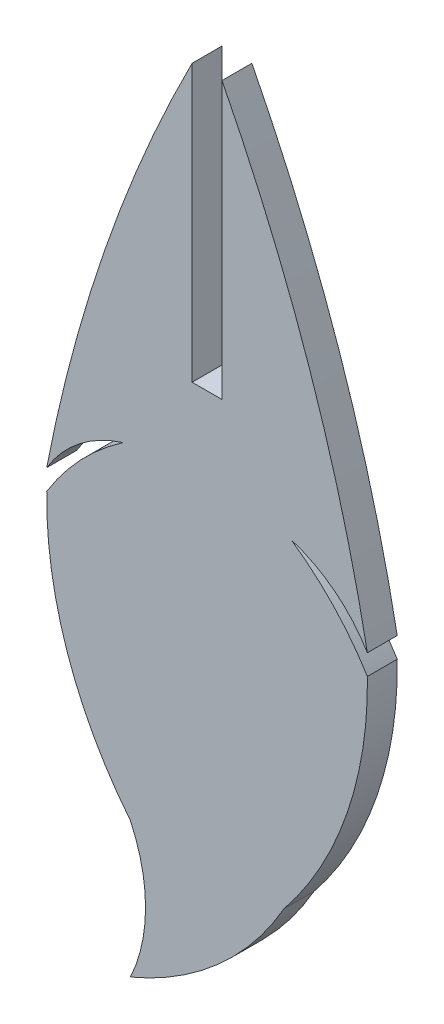
ISO-10303-21;
HEADER;
FILE_DESCRIPTION(('STEP AP214'),'2;1');
FILE_NAME('part.step','',(''),(''),'','','');
FILE_SCHEMA(('AUTOMOTIVE_DESIGN { 1 0 10303 214 1 1 1 1 }'));
ENDSEC;
DATA;
#1=APPLICATION_CONTEXT('core data for automotive mechanical design processes');
#2=APPLICATION_PROTOCOL_DEFINITION('international standard','automotive_design',2000,#1);
#3=PRODUCT_CONTEXT('',#1,'mechanical');
#4=PRODUCT('Part','Part','',(#3));
#5=PRODUCT_RELATED_PRODUCT_CATEGORY('part','',(#4));
#6=PRODUCT_DEFINITION_FORMATION('','',#4);
#7=PRODUCT_DEFINITION_CONTEXT('part definition',#1,'design');
#8=PRODUCT_DEFINITION('design','',#6,#7);
#9=PRODUCT_DEFINITION_SHAPE('','',#8);
#10=(LENGTH_UNIT() NAMED_UNIT(*) SI_UNIT(.MILLI.,.METRE.));
#11=(NAMED_UNIT(*) PLANE_ANGLE_UNIT() SI_UNIT($,.RADIAN.));
#12=(NAMED_UNIT(*) SI_UNIT($,.STERADIAN.) SOLID_ANGLE_UNIT());
#13=UNCERTAINTY_MEASURE_WITH_UNIT(LENGTH_MEASURE(1.E-05),#10,'distance_accuracy_value','');
#14=(GEOMETRIC_REPRESENTATION_CONTEXT(3) GLOBAL_UNCERTAINTY_ASSIGNED_CONTEXT((#13)) GLOBAL_UNIT_ASSIGNED_CONTEXT((#10,
#11,#12)) REPRESENTATION_CONTEXT('',''));
#15=CARTESIAN_POINT('',(0.,0.,0.));
#16=DIRECTION('',(0.,0.,1.));
#17=DIRECTION('',(1.,0.,0.));
#18=AXIS2_PLACEMENT_3D('',#15,#16,#17);
#19=CARTESIAN_POINT('',(-1.52400000000002,-20.5840652523079,1.524));
#20=DIRECTION('',(-1.,0.,0.));
#21=DIRECTION('',(0.,-1.,0.));
#22=AXIS2_PLACEMENT_3D('',#19,#20,#21);
#23=PLANE('',#22);
#24=DIRECTION('',(0.,1.,0.));
#25=VECTOR('',#24,1.);
#26=CARTESIAN_POINT('',(-1.52400000000002,-20.5840652523079,0.));
#27=LINE('',#26,#25);
#28=CARTESIAN_POINT('',(-1.52400000000001,-34.6762018191849,0.));
#29=VERTEX_POINT('',#28);
#30=CARTESIAN_POINT('',(-1.52400000000001,-20.5840652523079,0.));
#31=VERTEX_POINT('',#30);
#32=EDGE_CURVE('E162',#29,#31,#27,.T.);
#33=ORIENTED_EDGE('',*,*,#32,.T.);
#34=DIRECTION('',(0.,0.,-1.));
#35=VECTOR('',#34,1.);
#36=CARTESIAN_POINT('',(-1.52400000000001,-20.5840652523079,1.524));
#37=LINE('',#36,#35);
#38=CARTESIAN_POINT('',(-1.52400000000001,-20.5840652523079,1.524));
#39=VERTEX_POINT('',#38);
#40=EDGE_CURVE('E11',#39,#31,#37,.T.);
#41=ORIENTED_EDGE('',*,*,#40,.F.);
#42=DIRECTION('',(0.,1.,0.));
#43=VECTOR('',#42,1.);
#44=CARTESIAN_POINT('',(-1.52400000000002,-20.5840652523079,1.524));
#45=LINE('',#44,#43);
#46=CARTESIAN_POINT('',(-1.52400000000001,-34.6762018191849,1.524));
#47=VERTEX_POINT('',#46);
#48=EDGE_CURVE('E186',#47,#39,#45,.T.);
#49=ORIENTED_EDGE('',*,*,#48,.F.);
#50=DIRECTION('',(0.,0.,-1.));
#51=VECTOR('',#50,1.);
#52=CARTESIAN_POINT('',(-1.52400000000001,-34.6762018191849,1.524));
#53=LINE('',#52,#51);
#54=EDGE_CURVE('E158',#47,#29,#53,.T.);
#55=ORIENTED_EDGE('',*,*,#54,.T.);
#56=EDGE_LOOP('',(#33,#41,#49,#55));
#57=FACE_BOUND('',#56,.T.);
#58=ADVANCED_FACE('F36',(#57),#23,.F.);
#59=CARTESIAN_POINT('',(70.4453125153491,-57.3849255412965,1.524));
#60=DIRECTION('',(0.,0.,-1.));
#61=DIRECTION('',(-1.,0.,0.));
#62=AXIS2_PLACEMENT_3D('',#59,#60,#61);
#63=CYLINDRICAL_SURFACE('',#62,80.832451787272);
#64=CARTESIAN_POINT('',(70.4453125153491,-57.3849255412965,0.));
#65=DIRECTION('',(0.,0.,1.));
#66=DIRECTION('',(1.,0.,0.));
#67=AXIS2_PLACEMENT_3D('',#64,#65,#66);
#68=CIRCLE('',#67,80.832451787272);
#69=CARTESIAN_POINT('',(-8.94003102636647,-42.1582222636516,0.));
#70=VERTEX_POINT('',#69);
#71=EDGE_CURVE('E165',#31,#70,#68,.T.);
#72=ORIENTED_EDGE('',*,*,#71,.T.);
#73=DIRECTION('',(0.,0.,-1.));
#74=VECTOR('',#73,1.);
#75=CARTESIAN_POINT('',(-8.94003102636647,-42.1582222636516,1.524));
#76=LINE('',#75,#74);
#77=CARTESIAN_POINT('',(-8.94003102636647,-42.1582222636516,1.524));
#78=VERTEX_POINT('',#77);
#79=EDGE_CURVE('E44',#78,#70,#76,.T.);
#80=ORIENTED_EDGE('',*,*,#79,.F.);
#81=CARTESIAN_POINT('',(70.4453125153491,-57.3849255412965,1.524));
#82=DIRECTION('',(0.,0.,1.));
#83=DIRECTION('',(1.,0.,0.));
#84=AXIS2_PLACEMENT_3D('',#81,#82,#83);
#85=CIRCLE('',#84,80.832451787272);
#86=EDGE_CURVE('E110',#39,#78,#85,.T.);
#87=ORIENTED_EDGE('',*,*,#86,.F.);
#88=ORIENTED_EDGE('',*,*,#40,.T.);
#89=EDGE_LOOP('',(#72,#80,#87,#88));
#90=FACE_BOUND('',#89,.T.);
#91=ADVANCED_FACE('F269',(#90),#63,.T.);
#92=CARTESIAN_POINT('',(-3.00506683337598,-45.7155767584329,1.524));
#93=DIRECTION('',(0.,0.,-1.));
#94=DIRECTION('',(-1.,0.,0.));
#95=AXIS2_PLACEMENT_3D('',#92,#93,#94);
#96=CYLINDRICAL_SURFACE('',#95,6.91943429578023);
#97=CARTESIAN_POINT('',(-3.00506683337598,-45.7155767584329,0.));
#98=DIRECTION('',(0.,0.,-1.));
#99=DIRECTION('',(-1.,0.,0.));
#100=AXIS2_PLACEMENT_3D('',#97,#98,#99);
#101=CIRCLE('',#100,6.91943429578023);
#102=CARTESIAN_POINT('',(-5.05111698954524,-39.1055654322656,0.));
#103=VERTEX_POINT('',#102);
#104=EDGE_CURVE('E167',#70,#103,#101,.T.);
#105=ORIENTED_EDGE('',*,*,#104,.T.);
#106=DIRECTION('',(0.,0.,-1.));
#107=VECTOR('',#106,1.);
#108=CARTESIAN_POINT('',(-5.05111698954524,-39.1055654322656,1.524));
#109=LINE('',#108,#107);
#110=CARTESIAN_POINT('',(-5.05111698954524,-39.1055654322656,1.524));
#111=VERTEX_POINT('',#110);
#112=EDGE_CURVE('E208',#111,#103,#109,.T.);
#113=ORIENTED_EDGE('',*,*,#112,.F.);
#114=CARTESIAN_POINT('',(-3.00506683337598,-45.7155767584329,1.524));
#115=DIRECTION('',(0.,0.,-1.));
#116=DIRECTION('',(-1.,0.,0.));
#117=AXIS2_PLACEMENT_3D('',#114,#115,#116);
#118=CIRCLE('',#117,6.91943429578023);
#119=EDGE_CURVE('E216',#78,#111,#118,.T.);
#120=ORIENTED_EDGE('',*,*,#119,.F.);
#121=ORIENTED_EDGE('',*,*,#79,.T.);
#122=EDGE_LOOP('',(#105,#113,#120,#121));
#123=FACE_BOUND('',#122,.T.);
#124=ADVANCED_FACE('F214',(#123),#96,.F.);
#125=CARTESIAN_POINT('',(2.68460265281356,-50.3408146091308,1.524));
#126=DIRECTION('',(0.,0.,-1.));
#127=DIRECTION('',(-1.,0.,0.));
#128=AXIS2_PLACEMENT_3D('',#125,#126,#127);
#129=CYLINDRICAL_SURFACE('',#128,13.6408277773537);
#130=CARTESIAN_POINT('',(2.68460265281356,-50.3408146091308,0.));
#131=DIRECTION('',(0.,0.,1.));
#132=DIRECTION('',(1.,0.,0.));
#133=AXIS2_PLACEMENT_3D('',#130,#131,#132);
#134=CIRCLE('',#133,13.6408277773537);
#135=CARTESIAN_POINT('',(-8.94003102636647,-43.2035830536677,0.));
#136=VERTEX_POINT('',#135);
#137=EDGE_CURVE('E169',#103,#136,#134,.T.);
#138=ORIENTED_EDGE('',*,*,#137,.T.);
#139=DIRECTION('',(0.,0.,-1.));
#140=VECTOR('',#139,1.);
#141=CARTESIAN_POINT('',(-8.94003102636647,-43.2035830536677,1.524));
#142=LINE('',#141,#140);
#143=CARTESIAN_POINT('',(-8.94003102636647,-43.2035830536677,1.524));
#144=VERTEX_POINT('',#143);
#145=EDGE_CURVE('E205',#144,#136,#142,.T.);
#146=ORIENTED_EDGE('',*,*,#145,.F.);
#147=CARTESIAN_POINT('',(2.68460265281356,-50.3408146091308,1.524));
#148=DIRECTION('',(0.,0.,1.));
#149=DIRECTION('',(1.,0.,0.));
#150=AXIS2_PLACEMENT_3D('',#147,#148,#149);
#151=CIRCLE('',#150,13.6408277773537);
#152=EDGE_CURVE('E234',#111,#144,#151,.T.);
#153=ORIENTED_EDGE('',*,*,#152,.F.);
#154=ORIENTED_EDGE('',*,*,#112,.T.);
#155=EDGE_LOOP('',(#138,#146,#153,#154));
#156=FACE_BOUND('',#155,.T.);
#157=ADVANCED_FACE('F225',(#156),#129,.T.);
#158=CARTESIAN_POINT('',(10.3162528167392,-43.5205794944691,1.524));
#159=DIRECTION('',(0.,0.,-1.));
#160=DIRECTION('',(-1.,0.,0.));
#161=AXIS2_PLACEMENT_3D('',#158,#159,#160);
#162=CYLINDRICAL_SURFACE('',#161,19.2588928599162);
#163=CARTESIAN_POINT('',(10.3162528167392,-43.5205794944691,0.));
#164=DIRECTION('',(0.,0.,1.));
#165=DIRECTION('',(1.,0.,0.));
#166=AXIS2_PLACEMENT_3D('',#163,#164,#165);
#167=CIRCLE('',#166,19.2588928599162);
#168=CARTESIAN_POINT('',(-4.67452599410139,-55.6111338586902,0.));
#169=VERTEX_POINT('',#168);
#170=EDGE_CURVE('E171',#136,#169,#167,.T.);
#171=ORIENTED_EDGE('',*,*,#170,.T.);
#172=DIRECTION('',(0.,0.,-1.));
#173=VECTOR('',#172,1.);
#174=CARTESIAN_POINT('',(-4.67452599410139,-55.6111338586902,1.524));
#175=LINE('',#174,#173);
#176=CARTESIAN_POINT('',(-4.67452599410139,-55.6111338586902,1.524));
#177=VERTEX_POINT('',#176);
#178=EDGE_CURVE('E202',#177,#169,#175,.T.);
#179=ORIENTED_EDGE('',*,*,#178,.F.);
#180=CARTESIAN_POINT('',(10.3162528167392,-43.5205794944691,1.524));
#181=DIRECTION('',(0.,0.,1.));
#182=DIRECTION('',(1.,0.,0.));
#183=AXIS2_PLACEMENT_3D('',#180,#181,#182);
#184=CIRCLE('',#183,19.2588928599162);
#185=EDGE_CURVE('E231',#144,#177,#184,.T.);
#186=ORIENTED_EDGE('',*,*,#185,.F.);
#187=ORIENTED_EDGE('',*,*,#145,.T.);
#188=EDGE_LOOP('',(#171,#179,#186,#187));
#189=FACE_BOUND('',#188,.T.);
#190=ADVANCED_FACE('F229',(#189),#162,.T.);
#191=CARTESIAN_POINT('',(-12.0071489357553,-59.0698509701753,1.524));
#192=DIRECTION('',(0.,0.,-1.));
#193=DIRECTION('',(-1.,0.,0.));
#194=AXIS2_PLACEMENT_3D('',#191,#192,#193);
#195=CYLINDRICAL_SURFACE('',#194,8.10740915840248);
#196=CARTESIAN_POINT('',(-12.0071489357553,-59.0698509701753,0.));
#197=DIRECTION('',(0.,0.,-1.));
#198=DIRECTION('',(-1.,0.,0.));
#199=AXIS2_PLACEMENT_3D('',#196,#197,#198);
#200=CIRCLE('',#199,8.10740915840248);
#201=CARTESIAN_POINT('',(-4.6745259941014,-62.5285680816603,0.));
#202=VERTEX_POINT('',#201);
#203=EDGE_CURVE('E173',#169,#202,#200,.T.);
#204=ORIENTED_EDGE('',*,*,#203,.T.);
#205=DIRECTION('',(0.,0.,-1.));
#206=VECTOR('',#205,1.);
#207=CARTESIAN_POINT('',(-4.6745259941014,-62.5285680816603,1.524));
#208=LINE('',#207,#206);
#209=CARTESIAN_POINT('',(-4.6745259941014,-62.5285680816603,1.524));
#210=VERTEX_POINT('',#209);
#211=EDGE_CURVE('E199',#210,#202,#208,.T.);
#212=ORIENTED_EDGE('',*,*,#211,.F.);
#213=CARTESIAN_POINT('',(-12.0071489357553,-59.0698509701753,1.524));
#214=DIRECTION('',(0.,0.,-1.));
#215=DIRECTION('',(-1.,0.,0.));
#216=AXIS2_PLACEMENT_3D('',#213,#214,#215);
#217=CIRCLE('',#216,8.10740915840248);
#218=EDGE_CURVE('E233',#177,#210,#217,.T.);
#219=ORIENTED_EDGE('',*,*,#218,.F.);
#220=ORIENTED_EDGE('',*,*,#178,.T.);
#221=EDGE_LOOP('',(#204,#212,#219,#220));
#222=FACE_BOUND('',#221,.T.);
#223=ADVANCED_FACE('F282',(#222),#195,.F.);
#224=CARTESIAN_POINT('',(-10.9165958552882,-47.58289815999,1.524));
#225=DIRECTION('',(0.,0.,-1.));
#226=DIRECTION('',(-1.,0.,0.));
#227=AXIS2_PLACEMENT_3D('',#224,#225,#226);
#228=CYLINDRICAL_SURFACE('',#227,16.1968047947568);
#229=CARTESIAN_POINT('',(-10.9165958552882,-47.58289815999,0.));
#230=DIRECTION('',(0.,0.,1.));
#231=DIRECTION('',(1.,0.,0.));
#232=AXIS2_PLACEMENT_3D('',#229,#230,#231);
#233=CIRCLE('',#232,16.1968047947568);
#234=CARTESIAN_POINT('',(3.15052599410137,-55.6111338586902,0.));
#235=VERTEX_POINT('',#234);
#236=EDGE_CURVE('E175',#202,#235,#233,.T.);
#237=ORIENTED_EDGE('',*,*,#236,.T.);
#238=DIRECTION('',(0.,0.,-1.));
#239=VECTOR('',#238,1.);
#240=CARTESIAN_POINT('',(3.15052599410137,-55.6111338586902,1.524));
#241=LINE('',#240,#239);
#242=CARTESIAN_POINT('',(3.15052599410137,-55.6111338586902,1.524));
#243=VERTEX_POINT('',#242);
#244=EDGE_CURVE('E196',#243,#235,#241,.T.);
#245=ORIENTED_EDGE('',*,*,#244,.F.);
#246=CARTESIAN_POINT('',(-10.9165958552882,-47.58289815999,1.524));
#247=DIRECTION('',(0.,0.,1.));
#248=DIRECTION('',(1.,0.,0.));
#249=AXIS2_PLACEMENT_3D('',#246,#247,#248);
#250=CIRCLE('',#249,16.1968047947568);
#251=EDGE_CURVE('E236',#210,#243,#250,.T.);
#252=ORIENTED_EDGE('',*,*,#251,.F.);
#253=ORIENTED_EDGE('',*,*,#211,.T.);
#254=EDGE_LOOP('',(#237,#245,#252,#253));
#255=FACE_BOUND('',#254,.T.);
#256=ADVANCED_FACE('F285',(#255),#228,.T.);
#257=CARTESIAN_POINT('',(-11.8402528167392,-43.5205794944691,1.524));
#258=DIRECTION('',(0.,0.,-1.));
#259=DIRECTION('',(-1.,0.,0.));
#260=AXIS2_PLACEMENT_3D('',#257,#258,#259);
#261=CYLINDRICAL_SURFACE('',#260,19.2588928599162);
#262=CARTESIAN_POINT('',(-11.8402528167392,-43.5205794944691,0.));
#263=DIRECTION('',(0.,0.,1.));
#264=DIRECTION('',(-1.,0.,0.));
#265=AXIS2_PLACEMENT_3D('',#262,#263,#264);
#266=CIRCLE('',#265,19.2588928599162);
#267=CARTESIAN_POINT('',(7.41603102636646,-43.2035830536677,0.));
#268=VERTEX_POINT('',#267);
#269=EDGE_CURVE('E177',#235,#268,#266,.T.);
#270=ORIENTED_EDGE('',*,*,#269,.T.);
#271=DIRECTION('',(0.,0.,-1.));
#272=VECTOR('',#271,1.);
#273=CARTESIAN_POINT('',(7.41603102636646,-43.2035830536677,1.524));
#274=LINE('',#273,#272);
#275=CARTESIAN_POINT('',(7.41603102636646,-43.2035830536677,1.524));
#276=VERTEX_POINT('',#275);
#277=EDGE_CURVE('E193',#276,#268,#274,.T.);
#278=ORIENTED_EDGE('',*,*,#277,.F.);
#279=CARTESIAN_POINT('',(-11.8402528167392,-43.5205794944691,1.524));
#280=DIRECTION('',(0.,0.,1.));
#281=DIRECTION('',(-1.,0.,0.));
#282=AXIS2_PLACEMENT_3D('',#279,#280,#281);
#283=CIRCLE('',#282,19.2588928599162);
#284=EDGE_CURVE('E242',#243,#276,#283,.T.);
#285=ORIENTED_EDGE('',*,*,#284,.F.);
#286=ORIENTED_EDGE('',*,*,#244,.T.);
#287=EDGE_LOOP('',(#270,#278,#285,#286));
#288=FACE_BOUND('',#287,.T.);
#289=ADVANCED_FACE('F289',(#288),#261,.T.);
#290=CARTESIAN_POINT('',(-4.20860265281357,-50.3408146091308,1.524));
#291=DIRECTION('',(0.,0.,-1.));
#292=DIRECTION('',(-1.,0.,0.));
#293=AXIS2_PLACEMENT_3D('',#290,#291,#292);
#294=CYLINDRICAL_SURFACE('',#293,13.6408277773537);
#295=CARTESIAN_POINT('',(-4.20860265281357,-50.3408146091308,0.));
#296=DIRECTION('',(0.,0.,1.));
#297=DIRECTION('',(-1.,0.,0.));
#298=AXIS2_PLACEMENT_3D('',#295,#296,#297);
#299=CIRCLE('',#298,13.6408277773537);
#300=CARTESIAN_POINT('',(3.52711698954522,-39.1055654322656,0.));
#301=VERTEX_POINT('',#300);
#302=EDGE_CURVE('E179',#268,#301,#299,.T.);
#303=ORIENTED_EDGE('',*,*,#302,.T.);
#304=DIRECTION('',(0.,0.,-1.));
#305=VECTOR('',#304,1.);
#306=CARTESIAN_POINT('',(3.52711698954522,-39.1055654322656,1.524));
#307=LINE('',#306,#305);
#308=CARTESIAN_POINT('',(3.52711698954522,-39.1055654322656,1.524));
#309=VERTEX_POINT('',#308);
#310=EDGE_CURVE('E190',#309,#301,#307,.T.);
#311=ORIENTED_EDGE('',*,*,#310,.F.);
#312=CARTESIAN_POINT('',(-4.20860265281357,-50.3408146091308,1.524));
#313=DIRECTION('',(0.,0.,1.));
#314=DIRECTION('',(-1.,0.,0.));
#315=AXIS2_PLACEMENT_3D('',#312,#313,#314);
#316=CIRCLE('',#315,13.6408277773537);
#317=EDGE_CURVE('E244',#276,#309,#316,.T.);
#318=ORIENTED_EDGE('',*,*,#317,.F.);
#319=ORIENTED_EDGE('',*,*,#277,.T.);
#320=EDGE_LOOP('',(#303,#311,#318,#319));
#321=FACE_BOUND('',#320,.T.);
#322=ADVANCED_FACE('F250',(#321),#294,.T.);
#323=CARTESIAN_POINT('',(1.48106683337597,-45.7155767584329,1.524));
#324=DIRECTION('',(0.,0.,-1.));
#325=DIRECTION('',(-1.,0.,0.));
#326=AXIS2_PLACEMENT_3D('',#323,#324,#325);
#327=CYLINDRICAL_SURFACE('',#326,6.91943429578023);
#328=CARTESIAN_POINT('',(1.48106683337597,-45.7155767584329,0.));
#329=DIRECTION('',(0.,0.,-1.));
#330=DIRECTION('',(1.,0.,0.));
#331=AXIS2_PLACEMENT_3D('',#328,#329,#330);
#332=CIRCLE('',#331,6.91943429578023);
#333=CARTESIAN_POINT('',(7.41603102636644,-42.1582222636516,0.));
#334=VERTEX_POINT('',#333);
#335=EDGE_CURVE('E181',#301,#334,#332,.T.);
#336=ORIENTED_EDGE('',*,*,#335,.T.);
#337=DIRECTION('',(0.,0.,-1.));
#338=VECTOR('',#337,1.);
#339=CARTESIAN_POINT('',(7.41603102636644,-42.1582222636516,1.524));
#340=LINE('',#339,#338);
#341=CARTESIAN_POINT('',(7.41603102636644,-42.1582222636516,1.524));
#342=VERTEX_POINT('',#341);
#343=EDGE_CURVE('E153',#342,#334,#340,.T.);
#344=ORIENTED_EDGE('',*,*,#343,.F.);
#345=CARTESIAN_POINT('',(1.48106683337597,-45.7155767584329,1.524));
#346=DIRECTION('',(0.,0.,-1.));
#347=DIRECTION('',(1.,0.,0.));
#348=AXIS2_PLACEMENT_3D('',#345,#346,#347);
#349=CIRCLE('',#348,6.91943429578023);
#350=EDGE_CURVE('E144',#309,#342,#349,.T.);
#351=ORIENTED_EDGE('',*,*,#350,.F.);
#352=ORIENTED_EDGE('',*,*,#310,.T.);
#353=EDGE_LOOP('',(#336,#344,#351,#352));
#354=FACE_BOUND('',#353,.T.);
#355=ADVANCED_FACE('F254',(#354),#327,.F.);
#356=CARTESIAN_POINT('',(-71.9693125153492,-57.3849255412965,1.524));
#357=DIRECTION('',(0.,0.,-1.));
#358=DIRECTION('',(-1.,0.,0.));
#359=AXIS2_PLACEMENT_3D('',#356,#357,#358);
#360=CYLINDRICAL_SURFACE('',#359,80.832451787272);
#361=CARTESIAN_POINT('',(-71.9693125153492,-57.3849255412965,0.));
#362=DIRECTION('',(0.,0.,1.));
#363=DIRECTION('',(-1.,0.,0.));
#364=AXIS2_PLACEMENT_3D('',#361,#362,#363);
#365=CIRCLE('',#364,80.832451787272);
#366=CARTESIAN_POINT('',(0.,-20.5840652523079,0.));
#367=VERTEX_POINT('',#366);
#368=EDGE_CURVE('E152',#334,#367,#365,.T.);
#369=ORIENTED_EDGE('',*,*,#368,.T.);
#370=DIRECTION('',(0.,0.,-1.));
#371=VECTOR('',#370,1.);
#372=CARTESIAN_POINT('',(0.,-20.5840652523079,1.524));
#373=LINE('',#372,#371);
#374=CARTESIAN_POINT('',(0.,-20.5840652523079,1.524));
#375=VERTEX_POINT('',#374);
#376=EDGE_CURVE('E149',#375,#367,#373,.T.);
#377=ORIENTED_EDGE('',*,*,#376,.F.);
#378=CARTESIAN_POINT('',(-71.9693125153492,-57.3849255412965,1.524));
#379=DIRECTION('',(0.,0.,1.));
#380=DIRECTION('',(-1.,0.,0.));
#381=AXIS2_PLACEMENT_3D('',#378,#379,#380);
#382=CIRCLE('',#381,80.832451787272);
#383=EDGE_CURVE('E138',#342,#375,#382,.T.);
#384=ORIENTED_EDGE('',*,*,#383,.F.);
#385=ORIENTED_EDGE('',*,*,#343,.T.);
#386=EDGE_LOOP('',(#369,#377,#384,#385));
#387=FACE_BOUND('',#386,.T.);
#388=ADVANCED_FACE('F150',(#387),#360,.T.);
#389=CARTESIAN_POINT('',(0.,-34.6762018191849,1.524));
#390=DIRECTION('',(1.,0.,0.));
#391=DIRECTION('',(0.,1.,0.));
#392=AXIS2_PLACEMENT_3D('',#389,#390,#391);
#393=PLANE('',#392);
#394=DIRECTION('',(0.,-1.,0.));
#395=VECTOR('',#394,1.);
#396=CARTESIAN_POINT('',(0.,-34.6762018191849,0.));
#397=LINE('',#396,#395);
#398=CARTESIAN_POINT('',(0.,-34.6762018191849,0.));
#399=VERTEX_POINT('',#398);
#400=EDGE_CURVE('E96',#367,#399,#397,.T.);
#401=ORIENTED_EDGE('',*,*,#400,.T.);
#402=DIRECTION('',(0.,0.,-1.));
#403=VECTOR('',#402,1.);
#404=CARTESIAN_POINT('',(0.,-34.6762018191849,1.524));
#405=LINE('',#404,#403);
#406=CARTESIAN_POINT('',(0.,-34.6762018191849,1.524));
#407=VERTEX_POINT('',#406);
#408=EDGE_CURVE('E154',#407,#399,#405,.T.);
#409=ORIENTED_EDGE('',*,*,#408,.F.);
#410=DIRECTION('',(0.,-1.,0.));
#411=VECTOR('',#410,1.);
#412=CARTESIAN_POINT('',(0.,-34.6762018191849,1.524));
#413=LINE('',#412,#411);
#414=EDGE_CURVE('E142',#375,#407,#413,.T.);
#415=ORIENTED_EDGE('',*,*,#414,.F.);
#416=ORIENTED_EDGE('',*,*,#376,.T.);
#417=EDGE_LOOP('',(#401,#409,#415,#416));
#418=FACE_BOUND('',#417,.T.);
#419=ADVANCED_FACE('F156',(#418),#393,.F.);
#420=CARTESIAN_POINT('',(-1.52400000000001,-34.6762018191849,1.524));
#421=DIRECTION('',(0.,-1.,0.));
#422=DIRECTION('',(0.,0.,-1.));
#423=AXIS2_PLACEMENT_3D('',#420,#421,#422);
#424=PLANE('',#423);
#425=DIRECTION('',(-1.,0.,0.));
#426=VECTOR('',#425,1.);
#427=CARTESIAN_POINT('',(-1.52400000000001,-34.6762018191849,0.));
#428=LINE('',#427,#426);
#429=EDGE_CURVE('E102',#399,#29,#428,.T.);
#430=ORIENTED_EDGE('',*,*,#429,.T.);
#431=ORIENTED_EDGE('',*,*,#54,.F.);
#432=DIRECTION('',(-1.,0.,0.));
#433=VECTOR('',#432,1.);
#434=CARTESIAN_POINT('',(-1.52400000000001,-34.6762018191849,1.524));
#435=LINE('',#434,#433);
#436=EDGE_CURVE('E52',#407,#47,#435,.T.);
#437=ORIENTED_EDGE('',*,*,#436,.F.);
#438=ORIENTED_EDGE('',*,*,#408,.T.);
#439=EDGE_LOOP('',(#430,#431,#437,#438));
#440=FACE_BOUND('',#439,.T.);
#441=ADVANCED_FACE('F258',(#440),#424,.F.);
#442=CARTESIAN_POINT('',(-71.9693125153492,-57.3849255412965,1.524));
#443=DIRECTION('',(0.,0.,-1.));
#444=DIRECTION('',(-1.,0.,0.));
#445=AXIS2_PLACEMENT_3D('',#442,#443,#444);
#446=PLANE('',#445);
#447=ORIENTED_EDGE('',*,*,#48,.T.);
#448=ORIENTED_EDGE('',*,*,#86,.T.);
#449=ORIENTED_EDGE('',*,*,#119,.T.);
#450=ORIENTED_EDGE('',*,*,#152,.T.);
#451=ORIENTED_EDGE('',*,*,#185,.T.);
#452=ORIENTED_EDGE('',*,*,#218,.T.);
#453=ORIENTED_EDGE('',*,*,#251,.T.);
#454=ORIENTED_EDGE('',*,*,#284,.T.);
#455=ORIENTED_EDGE('',*,*,#317,.T.);
#456=ORIENTED_EDGE('',*,*,#350,.T.);
#457=ORIENTED_EDGE('',*,*,#383,.T.);
#458=ORIENTED_EDGE('',*,*,#414,.T.);
#459=ORIENTED_EDGE('',*,*,#436,.T.);
#460=EDGE_LOOP('',(#447,#448,#449,#450,#451,#452,#453,#454,#455,#456,#457,#458,#459));
#461=FACE_BOUND('',#460,.T.);
#462=ADVANCED_FACE('F140',(#461),#446,.F.);
#463=CARTESIAN_POINT('',(-71.9693125153492,-57.3849255412965,0.));
#464=DIRECTION('',(0.,0.,-1.));
#465=DIRECTION('',(-1.,0.,0.));
#466=AXIS2_PLACEMENT_3D('',#463,#464,#465);
#467=PLANE('',#466);
#468=ORIENTED_EDGE('',*,*,#32,.F.);
#469=ORIENTED_EDGE('',*,*,#429,.F.);
#470=ORIENTED_EDGE('',*,*,#400,.F.);
#471=ORIENTED_EDGE('',*,*,#368,.F.);
#472=ORIENTED_EDGE('',*,*,#335,.F.);
#473=ORIENTED_EDGE('',*,*,#302,.F.);
#474=ORIENTED_EDGE('',*,*,#269,.F.);
#475=ORIENTED_EDGE('',*,*,#236,.F.);
#476=ORIENTED_EDGE('',*,*,#203,.F.);
#477=ORIENTED_EDGE('',*,*,#170,.F.);
#478=ORIENTED_EDGE('',*,*,#137,.F.);
#479=ORIENTED_EDGE('',*,*,#104,.F.);
#480=ORIENTED_EDGE('',*,*,#71,.F.);
#481=EDGE_LOOP('',(#468,#469,#470,#471,#472,#473,#474,#475,#476,#477,#478,#479,#480));
#482=FACE_BOUND('',#481,.T.);
#483=ADVANCED_FACE('F220',(#482),#467,.T.);
#484=CLOSED_SHELL('',(#58,#91,#124,#157,#190,#223,#256,#289,#322,#355,#388,#419,#441,#462,#483));
#485=MANIFOLD_SOLID_BREP('B2',#484);
#486=ADVANCED_BREP_SHAPE_REPRESENTATION('',(#18,#485),#14);
#487=SHAPE_DEFINITION_REPRESENTATION(#9,#486);
ENDSEC;
END-ISO-10303-21;
